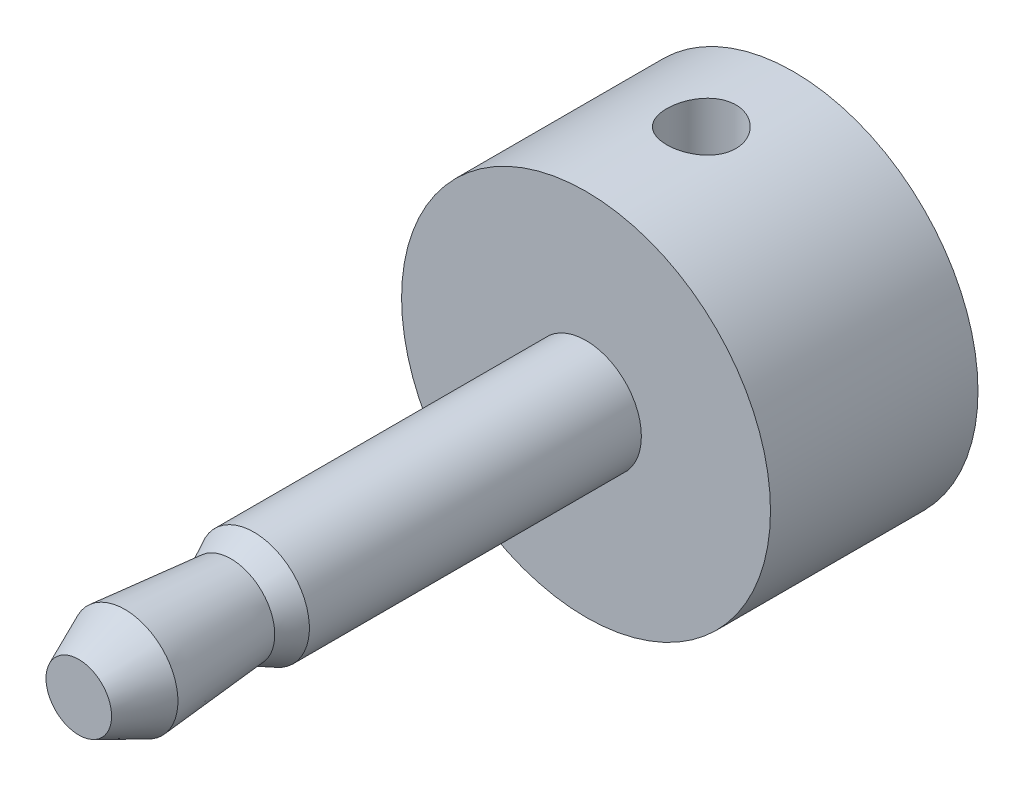
ISO-10303-21;
HEADER;
FILE_DESCRIPTION(('STEP AP214'),'2;1');
FILE_NAME('part.step','',(''),(''),'','','');
FILE_SCHEMA(('AUTOMOTIVE_DESIGN { 1 0 10303 214 1 1 1 1 }'));
ENDSEC;
DATA;
#1=APPLICATION_CONTEXT('core data for automotive mechanical design processes');
#2=APPLICATION_PROTOCOL_DEFINITION('international standard','automotive_design',2000,#1);
#3=PRODUCT_CONTEXT('',#1,'mechanical');
#4=PRODUCT('Part','Part','',(#3));
#5=PRODUCT_RELATED_PRODUCT_CATEGORY('part','',(#4));
#6=PRODUCT_DEFINITION_FORMATION('','',#4);
#7=PRODUCT_DEFINITION_CONTEXT('part definition',#1,'design');
#8=PRODUCT_DEFINITION('design','',#6,#7);
#9=PRODUCT_DEFINITION_SHAPE('','',#8);
#10=(LENGTH_UNIT() NAMED_UNIT(*) SI_UNIT(.MILLI.,.METRE.));
#11=(NAMED_UNIT(*) PLANE_ANGLE_UNIT() SI_UNIT($,.RADIAN.));
#12=(NAMED_UNIT(*) SI_UNIT($,.STERADIAN.) SOLID_ANGLE_UNIT());
#13=UNCERTAINTY_MEASURE_WITH_UNIT(LENGTH_MEASURE(1.E-05),#10,'distance_accuracy_value','');
#14=(GEOMETRIC_REPRESENTATION_CONTEXT(3) GLOBAL_UNCERTAINTY_ASSIGNED_CONTEXT((#13)) GLOBAL_UNIT_ASSIGNED_CONTEXT((#10,
#11,#12)) REPRESENTATION_CONTEXT('',''));
#15=CARTESIAN_POINT('',(0.,0.,0.));
#16=DIRECTION('',(0.,0.,1.));
#17=DIRECTION('',(1.,0.,0.));
#18=AXIS2_PLACEMENT_3D('',#15,#16,#17);
#19=CARTESIAN_POINT('',(0.,0.,5.5));
#20=DIRECTION('',(0.,0.,-1.));
#21=DIRECTION('',(-1.,0.,0.));
#22=AXIS2_PLACEMENT_3D('',#19,#20,#21);
#23=CYLINDRICAL_SURFACE('',#22,4.);
#24=CARTESIAN_POINT('',(0.,0.,5.5));
#25=DIRECTION('',(0.,0.,1.));
#26=DIRECTION('',(1.,0.,0.));
#27=AXIS2_PLACEMENT_3D('',#24,#25,#26);
#28=CIRCLE('',#27,4.);
#29=CARTESIAN_POINT('',(4.,0.,5.5));
#30=VERTEX_POINT('',#29);
#31=EDGE_CURVE('E65',#30,#30,#28,.T.);
#32=ORIENTED_EDGE('',*,*,#31,.F.);
#33=EDGE_LOOP('',(#32));
#34=FACE_BOUND('',#33,.T.);
#35=CARTESIAN_POINT('',(0.,4.,3.75));
#36=CARTESIAN_POINT('',(-0.0417358732327354,3.99999924416926,3.74999840520586));
#37=CARTESIAN_POINT('',(-0.0834924963650492,3.99934004960857,3.74650446169031));
#38=CARTESIAN_POINT('',(-0.165829064920899,3.9967739294526,3.73263000244083));
#39=CARTESIAN_POINT('',(-0.206407987076113,3.99486595083448,3.72224367468013));
#40=CARTESIAN_POINT('',(-0.2851864809259,3.99001569382729,3.69491364937033));
#41=CARTESIAN_POINT('',(-0.323388165342672,3.98707434973241,3.67797587377373));
#42=CARTESIAN_POINT('',(-0.396403986547003,3.98047855299892,3.63804056153859));
#43=CARTESIAN_POINT('',(-0.431218397238661,3.97682415809145,3.61504351542759));
#44=CARTESIAN_POINT('',(-0.496891857965251,3.96915668215252,3.56335011599816));
#45=CARTESIAN_POINT('',(-0.527704477515916,3.96514017428176,3.53459527766493));
#46=CARTESIAN_POINT('',(-0.584098030676846,3.95722659229325,3.47232834545622));
#47=CARTESIAN_POINT('',(-0.609678588446208,3.95332952677264,3.43881591011536));
#48=CARTESIAN_POINT('',(-0.655074993328964,3.94606275622503,3.36765695581801));
#49=CARTESIAN_POINT('',(-0.674843609848026,3.94269746943091,3.32997981484138));
#50=CARTESIAN_POINT('',(-0.707752621661415,3.93692356605994,3.25176554241161));
#51=CARTESIAN_POINT('',(-0.720893588565491,3.93451486698481,3.21122865794439));
#52=CARTESIAN_POINT('',(-0.740025267517501,3.93096134787275,3.12894238454279));
#53=CARTESIAN_POINT('',(-0.746096950960195,3.92980222683202,3.08721245139827));
#54=CARTESIAN_POINT('',(-0.751169040476732,3.92883598576381,3.00331130759588));
#55=CARTESIAN_POINT('',(-0.75017008067687,3.9290287444938,2.96114013684885));
#56=CARTESIAN_POINT('',(-0.741194898011812,3.93073146350876,2.87814023736698));
#57=CARTESIAN_POINT('',(-0.733310749980224,3.93222404073667,2.83730114284992));
#58=CARTESIAN_POINT('',(-0.710933996981035,3.93633091642333,2.7575357901087));
#59=CARTESIAN_POINT('',(-0.696441111197497,3.93894526254758,2.71860961324535));
#60=CARTESIAN_POINT('',(-0.661168235896499,3.94501927646294,2.64350566049987));
#61=CARTESIAN_POINT('',(-0.640351067662279,3.94848391911683,2.6073457647096));
#62=CARTESIAN_POINT('',(-0.593046844652081,3.95586485801459,2.53899763572988));
#63=CARTESIAN_POINT('',(-0.56655921444633,3.95978120007761,2.5068098061426));
#64=CARTESIAN_POINT('',(-0.508169528426488,3.96770000636082,2.44678752216377));
#65=CARTESIAN_POINT('',(-0.476188718430341,3.97170285512015,2.41902967377413));
#66=CARTESIAN_POINT('',(-0.407984018549413,3.97928693054159,2.3692613796623));
#67=CARTESIAN_POINT('',(-0.371760086127884,3.98286815297623,2.34725099156479));
#68=CARTESIAN_POINT('',(-0.296017494437334,3.98921269838754,2.30959112306499));
#69=CARTESIAN_POINT('',(-0.256494782223247,3.99197499568144,2.29394961044105));
#70=CARTESIAN_POINT('',(-0.175319557699348,3.9963625270136,2.26954895345392));
#71=CARTESIAN_POINT('',(-0.133667272138893,3.99798788183997,2.26078907797732));
#72=CARTESIAN_POINT('',(-0.0500743264516921,3.9999018032099,2.25050698449086));
#73=CARTESIAN_POINT('',(-0.00814700631706709,4.00020975456139,2.24887980423514));
#74=CARTESIAN_POINT('',(0.0753806240460925,3.99950771799114,2.25262773977382));
#75=CARTESIAN_POINT('',(0.116980950240193,3.99849779482216,2.25800251153263));
#76=CARTESIAN_POINT('',(0.198340786609109,3.99528555750203,2.27551451759168));
#77=CARTESIAN_POINT('',(0.238112130523032,3.99309261187015,2.28759864126891));
#78=CARTESIAN_POINT('',(0.315064315912317,3.98775921106249,2.31812885338939));
#79=CARTESIAN_POINT('',(0.352244981297552,3.98461869155667,2.33657537378289));
#80=CARTESIAN_POINT('',(0.423408335756607,3.97769015178833,2.37953906407976));
#81=CARTESIAN_POINT('',(0.457351638507561,3.97389543087281,2.40412036926842));
#82=CARTESIAN_POINT('',(0.520669161632273,3.96609671744856,2.45856906868118));
#83=CARTESIAN_POINT('',(0.550042954880433,3.96209270542344,2.48843695650067));
#84=CARTESIAN_POINT('',(0.603786479360239,3.95426237848725,2.55308615945571));
#85=CARTESIAN_POINT('',(0.628084581092883,3.95043912930128,2.58792745406269));
#86=CARTESIAN_POINT('',(0.670483375288935,3.94346492789266,2.66125881226188));
#87=CARTESIAN_POINT('',(0.688584298069621,3.94031395068675,2.69974874018524));
#88=CARTESIAN_POINT('',(0.717973367564115,3.93506512104787,2.77910293362127));
#89=CARTESIAN_POINT('',(0.729294343973931,3.93296220218439,2.81995468977967));
#90=CARTESIAN_POINT('',(0.744903396631177,3.93003601901208,2.9030236112607));
#91=CARTESIAN_POINT('',(0.749192266353541,3.92921261032895,2.9452406219852));
#92=CARTESIAN_POINT('',(0.750588810741773,3.92894599901929,3.02912416572076));
#93=CARTESIAN_POINT('',(0.747809475017494,3.92948107987147,3.0707887904785));
#94=CARTESIAN_POINT('',(0.735395876894015,3.93182300329999,3.15304571102264));
#95=CARTESIAN_POINT('',(0.72576165544666,3.93362983827873,3.19363801321372));
#96=CARTESIAN_POINT('',(0.699959437916315,3.9383025401159,3.27253724239774));
#97=CARTESIAN_POINT('',(0.683803676986262,3.94116642297482,3.31084829567289));
#98=CARTESIAN_POINT('',(0.645429344561021,3.9476319377592,3.38423412712042));
#99=CARTESIAN_POINT('',(0.623210344740928,3.9512336218006,3.41930867642239));
#100=CARTESIAN_POINT('',(0.572947436697675,3.95883633053873,3.48579184002115));
#101=CARTESIAN_POINT('',(0.544821299321517,3.96284252676522,3.51713770628355));
#102=CARTESIAN_POINT('',(0.483713963371145,3.97076416959368,3.57470258123226));
#103=CARTESIAN_POINT('',(0.450731650945807,3.97467959513664,3.60092041049007));
#104=CARTESIAN_POINT('',(0.380492472535936,3.98201987984024,3.64770547631353));
#105=CARTESIAN_POINT('',(0.343199795320258,3.9854400049528,3.66821971424532));
#106=CARTESIAN_POINT('',(0.265645056826917,3.99135809690343,3.70265881830257));
#107=CARTESIAN_POINT('',(0.225385825852624,3.99385692939519,3.71658987352345));
#108=CARTESIAN_POINT('',(0.154173601412577,3.99714145353816,3.73463865720934));
#109=CARTESIAN_POINT('',(0.123636905125936,3.99820735439103,3.7403893151564));
#110=CARTESIAN_POINT('',(0.0620706235575793,3.99963689977005,3.74807053105822));
#111=CARTESIAN_POINT('',(0.0310410508263549,4.00000056214902,3.75000118612795));
#112=CARTESIAN_POINT('',(0.,4.,3.75));
#113=B_SPLINE_CURVE_WITH_KNOTS('',3,(#35,#36,#37,#38,#39,#40,#41,#42,#43,#44,#45,#46,#47,#48,
#49,#50,#51,#52,#53,#54,#55,#56,#57,#58,#59,#60,#61,#62,#63,#64,#65,#66,#67,#68,#69,#70,#71,#72,
#73,#74,#75,#76,#77,#78,#79,#80,#81,#82,#83,#84,#85,#86,#87,#88,#89,#90,#91,#92,#93,#94,#95,#96,
#97,#98,#99,#100,#101,#102,#103,#104,#105,#106,#107,#108,#109,#110,#111,#112),.UNSPECIFIED.,.T.,
.F.,(4,2,2,2,2,2,2,2,2,2,2,2,2,2,2,2,2,2,2,2,2,2,2,2,2,2,2,2,2,2,2,2,2,2,2,2,2,2,4),(0.,
0.125094100482462,0.250293821267726,0.375380635615453,0.500457326684453,0.626875590068152,
0.753302931418083,0.880730952521787,1.00814798155974,1.13409075722668,1.26002223793628,
1.38429500306383,1.50857304923393,1.63359631314765,1.7586322702493,1.88563884232039,
2.01264668772474,2.13981294160849,2.26696568336873,2.39224087038048,2.51750990232292,
2.64180116953914,2.76610087669016,2.89175889008854,3.01742864206549,3.14476718493649,
3.27210099477473,3.3988131390928,3.52551098473256,3.65019626115874,3.77488079270753,
3.89933248103846,4.02379296327712,4.1501168498319,4.27646975631128,4.40396024458157,
4.53133063465587,4.62437172262205,4.7174104451977),.UNSPECIFIED.);
#114=CARTESIAN_POINT('',(0.,4.,3.75));
#115=VERTEX_POINT('',#114);
#116=EDGE_CURVE('E57',#115,#115,#113,.T.);
#117=ORIENTED_EDGE('',*,*,#116,.T.);
#118=EDGE_LOOP('',(#117));
#119=FACE_BOUND('',#118,.T.);
#120=CARTESIAN_POINT('',(0.,-4.,3.75));
#121=CARTESIAN_POINT('',(0.0417358732327354,-3.99999924416926,3.74999840520586));
#122=CARTESIAN_POINT('',(0.0834924963650492,-3.99934004960857,3.74650446169031));
#123=CARTESIAN_POINT('',(0.165829064920899,-3.9967739294526,3.73263000244083));
#124=CARTESIAN_POINT('',(0.206407987076113,-3.99486595083448,3.72224367468013));
#125=CARTESIAN_POINT('',(0.2851864809259,-3.99001569382729,3.69491364937033));
#126=CARTESIAN_POINT('',(0.323388165342672,-3.98707434973241,3.67797587377373));
#127=CARTESIAN_POINT('',(0.396403986547003,-3.98047855299892,3.63804056153859));
#128=CARTESIAN_POINT('',(0.431218397238661,-3.97682415809145,3.61504351542759));
#129=CARTESIAN_POINT('',(0.496891857965251,-3.96915668215252,3.56335011599816));
#130=CARTESIAN_POINT('',(0.527704477515916,-3.96514017428176,3.53459527766493));
#131=CARTESIAN_POINT('',(0.584098030676846,-3.95722659229325,3.47232834545622));
#132=CARTESIAN_POINT('',(0.609678588446208,-3.95332952677264,3.43881591011536));
#133=CARTESIAN_POINT('',(0.655074993328964,-3.94606275622503,3.36765695581801));
#134=CARTESIAN_POINT('',(0.674843609848026,-3.94269746943091,3.32997981484138));
#135=CARTESIAN_POINT('',(0.707752621661415,-3.93692356605994,3.25176554241161));
#136=CARTESIAN_POINT('',(0.720893588565491,-3.93451486698481,3.21122865794439));
#137=CARTESIAN_POINT('',(0.740025267517501,-3.93096134787275,3.12894238454279));
#138=CARTESIAN_POINT('',(0.746096950960195,-3.92980222683202,3.08721245139827));
#139=CARTESIAN_POINT('',(0.751169040476732,-3.92883598576381,3.00331130759588));
#140=CARTESIAN_POINT('',(0.75017008067687,-3.9290287444938,2.96114013684885));
#141=CARTESIAN_POINT('',(0.741194898011812,-3.93073146350876,2.87814023736698));
#142=CARTESIAN_POINT('',(0.733310749980224,-3.93222404073667,2.83730114284992));
#143=CARTESIAN_POINT('',(0.710933996981035,-3.93633091642333,2.7575357901087));
#144=CARTESIAN_POINT('',(0.696441111197497,-3.93894526254758,2.71860961324535));
#145=CARTESIAN_POINT('',(0.661168235896499,-3.94501927646294,2.64350566049987));
#146=CARTESIAN_POINT('',(0.640351067662279,-3.94848391911683,2.6073457647096));
#147=CARTESIAN_POINT('',(0.593046844652081,-3.95586485801459,2.53899763572988));
#148=CARTESIAN_POINT('',(0.56655921444633,-3.95978120007761,2.5068098061426));
#149=CARTESIAN_POINT('',(0.508169528426488,-3.96770000636082,2.44678752216377));
#150=CARTESIAN_POINT('',(0.476188718430341,-3.97170285512015,2.41902967377413));
#151=CARTESIAN_POINT('',(0.407984018549413,-3.97928693054159,2.3692613796623));
#152=CARTESIAN_POINT('',(0.371760086127884,-3.98286815297623,2.34725099156479));
#153=CARTESIAN_POINT('',(0.296017494437334,-3.98921269838754,2.30959112306499));
#154=CARTESIAN_POINT('',(0.256494782223247,-3.99197499568144,2.29394961044105));
#155=CARTESIAN_POINT('',(0.175319557699348,-3.9963625270136,2.26954895345392));
#156=CARTESIAN_POINT('',(0.133667272138893,-3.99798788183997,2.26078907797732));
#157=CARTESIAN_POINT('',(0.0500743264516921,-3.9999018032099,2.25050698449086));
#158=CARTESIAN_POINT('',(0.00814700631706709,-4.00020975456139,2.24887980423514));
#159=CARTESIAN_POINT('',(-0.0753806240460925,-3.99950771799114,2.25262773977382));
#160=CARTESIAN_POINT('',(-0.116980950240193,-3.99849779482216,2.25800251153263));
#161=CARTESIAN_POINT('',(-0.198340786609109,-3.99528555750203,2.27551451759168));
#162=CARTESIAN_POINT('',(-0.238112130523032,-3.99309261187015,2.28759864126891));
#163=CARTESIAN_POINT('',(-0.315064315912317,-3.98775921106249,2.31812885338939));
#164=CARTESIAN_POINT('',(-0.352244981297552,-3.98461869155667,2.33657537378289));
#165=CARTESIAN_POINT('',(-0.423408335756607,-3.97769015178833,2.37953906407976));
#166=CARTESIAN_POINT('',(-0.457351638507561,-3.97389543087281,2.40412036926842));
#167=CARTESIAN_POINT('',(-0.520669161632273,-3.96609671744856,2.45856906868118));
#168=CARTESIAN_POINT('',(-0.550042954880433,-3.96209270542344,2.48843695650067));
#169=CARTESIAN_POINT('',(-0.603786479360239,-3.95426237848725,2.55308615945571));
#170=CARTESIAN_POINT('',(-0.628084581092883,-3.95043912930128,2.58792745406269));
#171=CARTESIAN_POINT('',(-0.670483375288935,-3.94346492789266,2.66125881226188));
#172=CARTESIAN_POINT('',(-0.688584298069621,-3.94031395068675,2.69974874018524));
#173=CARTESIAN_POINT('',(-0.717973367564115,-3.93506512104787,2.77910293362127));
#174=CARTESIAN_POINT('',(-0.729294343973931,-3.93296220218439,2.81995468977967));
#175=CARTESIAN_POINT('',(-0.744903396631177,-3.93003601901208,2.9030236112607));
#176=CARTESIAN_POINT('',(-0.749192266353541,-3.92921261032895,2.9452406219852));
#177=CARTESIAN_POINT('',(-0.750588810741773,-3.92894599901929,3.02912416572076));
#178=CARTESIAN_POINT('',(-0.747809475017494,-3.92948107987147,3.0707887904785));
#179=CARTESIAN_POINT('',(-0.735395876894015,-3.93182300329999,3.15304571102264));
#180=CARTESIAN_POINT('',(-0.72576165544666,-3.93362983827873,3.19363801321372));
#181=CARTESIAN_POINT('',(-0.699959437916315,-3.9383025401159,3.27253724239774));
#182=CARTESIAN_POINT('',(-0.683803676986262,-3.94116642297482,3.31084829567289));
#183=CARTESIAN_POINT('',(-0.645429344561021,-3.9476319377592,3.38423412712042));
#184=CARTESIAN_POINT('',(-0.623210344740928,-3.9512336218006,3.41930867642239));
#185=CARTESIAN_POINT('',(-0.572947436697675,-3.95883633053873,3.48579184002115));
#186=CARTESIAN_POINT('',(-0.544821299321517,-3.96284252676522,3.51713770628355));
#187=CARTESIAN_POINT('',(-0.483713963371145,-3.97076416959368,3.57470258123226));
#188=CARTESIAN_POINT('',(-0.450731650945807,-3.97467959513664,3.60092041049007));
#189=CARTESIAN_POINT('',(-0.380492472535936,-3.98201987984024,3.64770547631353));
#190=CARTESIAN_POINT('',(-0.343199795320258,-3.9854400049528,3.66821971424532));
#191=CARTESIAN_POINT('',(-0.265645056826917,-3.99135809690343,3.70265881830257));
#192=CARTESIAN_POINT('',(-0.225385825852624,-3.99385692939519,3.71658987352345));
#193=CARTESIAN_POINT('',(-0.154173601412577,-3.99714145353816,3.73463865720934));
#194=CARTESIAN_POINT('',(-0.123636905125936,-3.99820735439103,3.7403893151564));
#195=CARTESIAN_POINT('',(-0.0620706235575793,-3.99963689977005,3.74807053105822));
#196=CARTESIAN_POINT('',(-0.0310410508263549,-4.00000056214902,3.75000118612795));
#197=CARTESIAN_POINT('',(0.,-4.,3.75));
#198=B_SPLINE_CURVE_WITH_KNOTS('',3,(#120,#121,#122,#123,#124,#125,#126,#127,#128,#129,#130,
#131,#132,#133,#134,#135,#136,#137,#138,#139,#140,#141,#142,#143,#144,#145,#146,#147,#148,#149,
#150,#151,#152,#153,#154,#155,#156,#157,#158,#159,#160,#161,#162,#163,#164,#165,#166,#167,#168,
#169,#170,#171,#172,#173,#174,#175,#176,#177,#178,#179,#180,#181,#182,#183,#184,#185,#186,#187,
#188,#189,#190,#191,#192,#193,#194,#195,#196,#197),.UNSPECIFIED.,.T.,.F.,(4,2,2,2,2,2,2,2,2,2,2,
2,2,2,2,2,2,2,2,2,2,2,2,2,2,2,2,2,2,2,2,2,2,2,2,2,2,2,4),(0.,0.125094100482462,
0.250293821267726,0.375380635615453,0.500457326684453,0.626875590068152,0.753302931418083,
0.880730952521787,1.00814798155974,1.13409075722668,1.26002223793628,1.38429500306383,
1.50857304923393,1.63359631314765,1.7586322702493,1.88563884232039,2.01264668772474,
2.13981294160849,2.26696568336873,2.39224087038048,2.51750990232292,2.64180116953914,
2.76610087669016,2.89175889008854,3.01742864206549,3.14476718493649,3.27210099477473,
3.3988131390928,3.52551098473256,3.65019626115874,3.77488079270753,3.89933248103846,
4.02379296327712,4.1501168498319,4.27646975631128,4.40396024458157,4.53133063465587,
4.62437172262205,4.7174104451977),.UNSPECIFIED.);
#199=CARTESIAN_POINT('',(0.,-4.,3.75));
#200=VERTEX_POINT('',#199);
#201=EDGE_CURVE('E12',#200,#200,#198,.T.);
#202=ORIENTED_EDGE('',*,*,#201,.T.);
#203=EDGE_LOOP('',(#202));
#204=FACE_BOUND('',#203,.T.);
#205=CARTESIAN_POINT('',(0.,0.,1.));
#206=DIRECTION('',(0.,0.,-1.));
#207=DIRECTION('',(-1.,0.,0.));
#208=AXIS2_PLACEMENT_3D('',#205,#206,#207);
#209=CIRCLE('',#208,4.);
#210=CARTESIAN_POINT('',(-4.,0.,1.));
#211=VERTEX_POINT('',#210);
#212=EDGE_CURVE('E115',#211,#211,#209,.T.);
#213=ORIENTED_EDGE('',*,*,#212,.F.);
#214=EDGE_LOOP('',(#213));
#215=FACE_BOUND('',#214,.T.);
#216=ADVANCED_FACE('F47',(#34,#119,#204,#215),#23,.T.);
#217=CARTESIAN_POINT('',(0.,0.,16.5));
#218=DIRECTION('',(0.,0.,-1.));
#219=DIRECTION('',(-1.,0.,0.));
#220=AXIS2_PLACEMENT_3D('',#217,#218,#219);
#221=CYLINDRICAL_SURFACE('',#220,1.2);
#222=CARTESIAN_POINT('',(0.,0.,5.5));
#223=DIRECTION('',(0.,0.,1.));
#224=DIRECTION('',(1.,0.,0.));
#225=AXIS2_PLACEMENT_3D('',#222,#223,#224);
#226=CIRCLE('',#225,1.2);
#227=CARTESIAN_POINT('',(1.2,0.,5.5));
#228=VERTEX_POINT('',#227);
#229=EDGE_CURVE('E61',#228,#228,#226,.T.);
#230=ORIENTED_EDGE('',*,*,#229,.T.);
#231=EDGE_LOOP('',(#230));
#232=FACE_BOUND('',#231,.T.);
#233=CARTESIAN_POINT('',(0.,0.,12.7));
#234=DIRECTION('',(0.,0.,-1.));
#235=DIRECTION('',(-1.,0.,0.));
#236=AXIS2_PLACEMENT_3D('',#233,#234,#235);
#237=CIRCLE('',#236,1.2);
#238=CARTESIAN_POINT('',(-1.2,0.,12.7));
#239=VERTEX_POINT('',#238);
#240=EDGE_CURVE('E117',#239,#239,#237,.T.);
#241=ORIENTED_EDGE('',*,*,#240,.T.);
#242=EDGE_LOOP('',(#241));
#243=FACE_BOUND('',#242,.T.);
#244=ADVANCED_FACE('F95',(#232,#243),#221,.T.);
#245=CARTESIAN_POINT('',(0.,0.,5.5));
#246=DIRECTION('',(0.,0.,1.));
#247=DIRECTION('',(1.,0.,0.));
#248=AXIS2_PLACEMENT_3D('',#245,#246,#247);
#249=PLANE('',#248);
#250=ORIENTED_EDGE('',*,*,#229,.F.);
#251=EDGE_LOOP('',(#250));
#252=FACE_BOUND('',#251,.T.);
#253=ORIENTED_EDGE('',*,*,#31,.T.);
#254=EDGE_LOOP('',(#253));
#255=FACE_BOUND('',#254,.T.);
#256=ADVANCED_FACE('F90',(#252,#255),#249,.T.);
#257=CARTESIAN_POINT('',(0.,0.,15.5));
#258=DIRECTION('',(0.,0.,-1.));
#259=DIRECTION('',(-1.,0.,0.));
#260=AXIS2_PLACEMENT_3D('',#257,#258,#259);
#261=CONICAL_SURFACE('',#260,1.15,0.413521799443509);
#262=CARTESIAN_POINT('',(0.,0.,16.5));
#263=DIRECTION('',(0.,0.,-1.));
#264=DIRECTION('',(-1.,0.,0.));
#265=AXIS2_PLACEMENT_3D('',#262,#263,#264);
#266=CIRCLE('',#265,0.711175276665016);
#267=CARTESIAN_POINT('',(-0.711175276665016,0.,16.5));
#268=VERTEX_POINT('',#267);
#269=EDGE_CURVE('E128',#268,#268,#266,.T.);
#270=ORIENTED_EDGE('',*,*,#269,.T.);
#271=EDGE_LOOP('',(#270));
#272=FACE_BOUND('',#271,.T.);
#273=CARTESIAN_POINT('',(0.,0.,15.5));
#274=DIRECTION('',(0.,0.,-1.));
#275=DIRECTION('',(-1.,0.,0.));
#276=AXIS2_PLACEMENT_3D('',#273,#274,#275);
#277=CIRCLE('',#276,1.15);
#278=CARTESIAN_POINT('',(-1.15,0.,15.5));
#279=VERTEX_POINT('',#278);
#280=EDGE_CURVE('E125',#279,#279,#277,.T.);
#281=ORIENTED_EDGE('',*,*,#280,.F.);
#282=EDGE_LOOP('',(#281));
#283=FACE_BOUND('',#282,.T.);
#284=ADVANCED_FACE('F86',(#272,#283),#261,.T.);
#285=CARTESIAN_POINT('',(0.,0.,13.2));
#286=DIRECTION('',(0.,0.,1.));
#287=DIRECTION('',(1.,0.,0.));
#288=AXIS2_PLACEMENT_3D('',#285,#286,#287);
#289=CONICAL_SURFACE('',#288,0.95,0.0867383386759853);
#290=ORIENTED_EDGE('',*,*,#280,.T.);
#291=EDGE_LOOP('',(#290));
#292=FACE_BOUND('',#291,.T.);
#293=CARTESIAN_POINT('',(0.,0.,13.2));
#294=DIRECTION('',(0.,0.,-1.));
#295=DIRECTION('',(-1.,0.,0.));
#296=AXIS2_PLACEMENT_3D('',#293,#294,#295);
#297=CIRCLE('',#296,0.95);
#298=CARTESIAN_POINT('',(-0.95,0.,13.2));
#299=VERTEX_POINT('',#298);
#300=EDGE_CURVE('E120',#299,#299,#297,.T.);
#301=ORIENTED_EDGE('',*,*,#300,.F.);
#302=EDGE_LOOP('',(#301));
#303=FACE_BOUND('',#302,.T.);
#304=ADVANCED_FACE('F82',(#292,#303),#289,.T.);
#305=CARTESIAN_POINT('',(0.,0.,12.7));
#306=DIRECTION('',(0.,0.,-1.));
#307=DIRECTION('',(-1.,0.,0.));
#308=AXIS2_PLACEMENT_3D('',#305,#306,#307);
#309=CONICAL_SURFACE('',#308,1.2,0.463647609000806);
#310=ORIENTED_EDGE('',*,*,#300,.T.);
#311=EDGE_LOOP('',(#310));
#312=FACE_BOUND('',#311,.T.);
#313=ORIENTED_EDGE('',*,*,#240,.F.);
#314=EDGE_LOOP('',(#313));
#315=FACE_BOUND('',#314,.T.);
#316=ADVANCED_FACE('F78',(#312,#315),#309,.T.);
#317=CARTESIAN_POINT('',(0.,0.,16.5));
#318=DIRECTION('',(0.,0.,1.));
#319=DIRECTION('',(1.,0.,0.));
#320=AXIS2_PLACEMENT_3D('',#317,#318,#319);
#321=PLANE('',#320);
#322=ORIENTED_EDGE('',*,*,#269,.F.);
#323=EDGE_LOOP('',(#322));
#324=FACE_BOUND('',#323,.T.);
#325=ADVANCED_FACE('F76',(#324),#321,.T.);
#326=CARTESIAN_POINT('',(0.,-4.,3.));
#327=DIRECTION('',(0.,1.,0.));
#328=DIRECTION('',(0.,0.,1.));
#329=AXIS2_PLACEMENT_3D('',#326,#327,#328);
#330=CYLINDRICAL_SURFACE('',#329,0.75);
#331=ORIENTED_EDGE('',*,*,#116,.F.);
#332=EDGE_LOOP('',(#331));
#333=FACE_BOUND('',#332,.T.);
#334=ORIENTED_EDGE('',*,*,#201,.F.);
#335=EDGE_LOOP('',(#334));
#336=FACE_BOUND('',#335,.T.);
#337=ADVANCED_FACE('F70',(#333,#336),#330,.F.);
#338=CARTESIAN_POINT('',(0.,0.,1.));
#339=DIRECTION('',(0.,0.,-1.));
#340=DIRECTION('',(-1.,0.,0.));
#341=AXIS2_PLACEMENT_3D('',#338,#339,#340);
#342=PLANE('',#341);
#343=ORIENTED_EDGE('',*,*,#212,.T.);
#344=EDGE_LOOP('',(#343));
#345=FACE_BOUND('',#344,.T.);
#346=ADVANCED_FACE('F75',(#345),#342,.T.);
#347=CLOSED_SHELL('',(#216,#244,#256,#284,#304,#316,#325,#337,#346));
#348=MANIFOLD_SOLID_BREP('B2',#347);
#349=ADVANCED_BREP_SHAPE_REPRESENTATION('',(#18,#348),#14);
#350=SHAPE_DEFINITION_REPRESENTATION(#9,#349);
ENDSEC;
END-ISO-10303-21;
